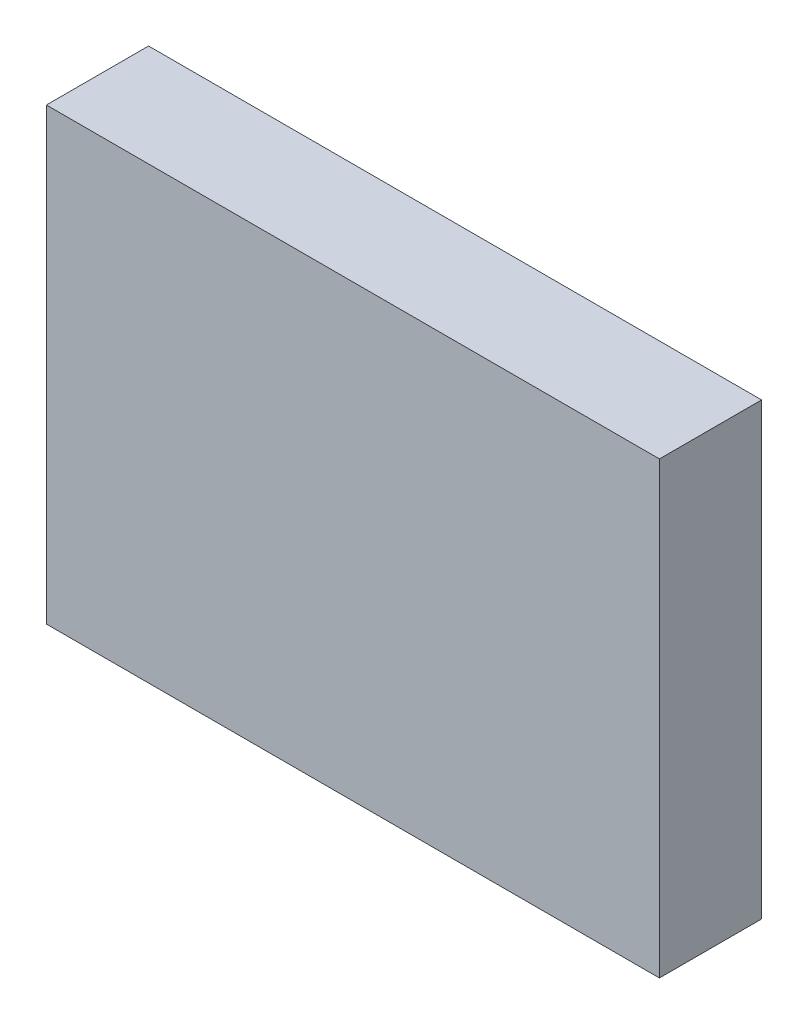
ISO-10303-21;
HEADER;
FILE_DESCRIPTION(('STEP AP214'),'2;1');
FILE_NAME('part.step','',(''),(''),'','','');
FILE_SCHEMA(('AUTOMOTIVE_DESIGN { 1 0 10303 214 1 1 1 1 }'));
ENDSEC;
DATA;
#1=APPLICATION_CONTEXT('core data for automotive mechanical design processes');
#2=APPLICATION_PROTOCOL_DEFINITION('international standard','automotive_design',2000,#1);
#3=PRODUCT_CONTEXT('',#1,'mechanical');
#4=PRODUCT('Part','Part','',(#3));
#5=PRODUCT_RELATED_PRODUCT_CATEGORY('part','',(#4));
#6=PRODUCT_DEFINITION_FORMATION('','',#4);
#7=PRODUCT_DEFINITION_CONTEXT('part definition',#1,'design');
#8=PRODUCT_DEFINITION('design','',#6,#7);
#9=PRODUCT_DEFINITION_SHAPE('','',#8);
#10=(LENGTH_UNIT() NAMED_UNIT(*) SI_UNIT(.MILLI.,.METRE.));
#11=(NAMED_UNIT(*) PLANE_ANGLE_UNIT() SI_UNIT($,.RADIAN.));
#12=(NAMED_UNIT(*) SI_UNIT($,.STERADIAN.) SOLID_ANGLE_UNIT());
#13=UNCERTAINTY_MEASURE_WITH_UNIT(LENGTH_MEASURE(1.E-05),#10,'distance_accuracy_value','');
#14=(GEOMETRIC_REPRESENTATION_CONTEXT(3) GLOBAL_UNCERTAINTY_ASSIGNED_CONTEXT((#13)) GLOBAL_UNIT_ASSIGNED_CONTEXT((#10,
#11,#12)) REPRESENTATION_CONTEXT('',''));
#15=CARTESIAN_POINT('',(0.,0.,0.));
#16=DIRECTION('',(0.,0.,1.));
#17=DIRECTION('',(1.,0.,0.));
#18=AXIS2_PLACEMENT_3D('',#15,#16,#17);
#19=CARTESIAN_POINT('',(7.5,5.5,2.5));
#20=DIRECTION('',(-1.,0.,0.));
#21=DIRECTION('',(0.,-1.,0.));
#22=AXIS2_PLACEMENT_3D('',#19,#20,#21);
#23=PLANE('',#22);
#24=DIRECTION('',(0.,1.,0.));
#25=VECTOR('',#24,1.);
#26=CARTESIAN_POINT('',(7.5,5.5,0.));
#27=LINE('',#26,#25);
#28=CARTESIAN_POINT('',(7.5,-5.5,0.));
#29=VERTEX_POINT('',#28);
#30=CARTESIAN_POINT('',(7.5,5.5,0.));
#31=VERTEX_POINT('',#30);
#32=EDGE_CURVE('E97',#29,#31,#27,.T.);
#33=ORIENTED_EDGE('',*,*,#32,.T.);
#34=DIRECTION('',(0.,0.,-1.));
#35=VECTOR('',#34,1.);
#36=CARTESIAN_POINT('',(7.5,5.5,2.5));
#37=LINE('',#36,#35);
#38=CARTESIAN_POINT('',(7.5,5.5,2.5));
#39=VERTEX_POINT('',#38);
#40=EDGE_CURVE('E11',#39,#31,#37,.T.);
#41=ORIENTED_EDGE('',*,*,#40,.F.);
#42=DIRECTION('',(0.,1.,0.));
#43=VECTOR('',#42,1.);
#44=CARTESIAN_POINT('',(7.5,5.5,2.5));
#45=LINE('',#44,#43);
#46=CARTESIAN_POINT('',(7.5,-5.5,2.5));
#47=VERTEX_POINT('',#46);
#48=EDGE_CURVE('E85',#47,#39,#45,.T.);
#49=ORIENTED_EDGE('',*,*,#48,.F.);
#50=DIRECTION('',(0.,0.,-1.));
#51=VECTOR('',#50,1.);
#52=CARTESIAN_POINT('',(7.5,-5.5,2.5));
#53=LINE('',#52,#51);
#54=EDGE_CURVE('E93',#47,#29,#53,.T.);
#55=ORIENTED_EDGE('',*,*,#54,.T.);
#56=EDGE_LOOP('',(#33,#41,#49,#55));
#57=FACE_BOUND('',#56,.T.);
#58=ADVANCED_FACE('F34',(#57),#23,.F.);
#59=CARTESIAN_POINT('',(-7.5,5.5,2.5));
#60=DIRECTION('',(0.,-1.,0.));
#61=DIRECTION('',(0.,0.,-1.));
#62=AXIS2_PLACEMENT_3D('',#59,#60,#61);
#63=PLANE('',#62);
#64=DIRECTION('',(-1.,0.,0.));
#65=VECTOR('',#64,1.);
#66=CARTESIAN_POINT('',(-7.5,5.5,0.));
#67=LINE('',#66,#65);
#68=CARTESIAN_POINT('',(-7.5,5.5,0.));
#69=VERTEX_POINT('',#68);
#70=EDGE_CURVE('E89',#31,#69,#67,.T.);
#71=ORIENTED_EDGE('',*,*,#70,.T.);
#72=DIRECTION('',(0.,0.,-1.));
#73=VECTOR('',#72,1.);
#74=CARTESIAN_POINT('',(-7.5,5.5,2.5));
#75=LINE('',#74,#73);
#76=CARTESIAN_POINT('',(-7.5,5.5,2.5));
#77=VERTEX_POINT('',#76);
#78=EDGE_CURVE('E42',#77,#69,#75,.T.);
#79=ORIENTED_EDGE('',*,*,#78,.F.);
#80=DIRECTION('',(-1.,0.,0.));
#81=VECTOR('',#80,1.);
#82=CARTESIAN_POINT('',(-7.5,5.5,2.5));
#83=LINE('',#82,#81);
#84=EDGE_CURVE('E80',#39,#77,#83,.T.);
#85=ORIENTED_EDGE('',*,*,#84,.F.);
#86=ORIENTED_EDGE('',*,*,#40,.T.);
#87=EDGE_LOOP('',(#71,#79,#85,#86));
#88=FACE_BOUND('',#87,.T.);
#89=ADVANCED_FACE('F88',(#88),#63,.F.);
#90=CARTESIAN_POINT('',(-7.5,5.5,2.5));
#91=DIRECTION('',(1.,0.,0.));
#92=DIRECTION('',(0.,1.,0.));
#93=AXIS2_PLACEMENT_3D('',#90,#91,#92);
#94=PLANE('',#93);
#95=DIRECTION('',(0.,-1.,0.));
#96=VECTOR('',#95,1.);
#97=CARTESIAN_POINT('',(-7.5,5.5,0.));
#98=LINE('',#97,#96);
#99=CARTESIAN_POINT('',(-7.5,-5.5,0.));
#100=VERTEX_POINT('',#99);
#101=EDGE_CURVE('E67',#69,#100,#98,.T.);
#102=ORIENTED_EDGE('',*,*,#101,.T.);
#103=DIRECTION('',(0.,0.,-1.));
#104=VECTOR('',#103,1.);
#105=CARTESIAN_POINT('',(-7.5,-5.5,2.5));
#106=LINE('',#105,#104);
#107=CARTESIAN_POINT('',(-7.5,-5.5,2.5));
#108=VERTEX_POINT('',#107);
#109=EDGE_CURVE('E90',#108,#100,#106,.T.);
#110=ORIENTED_EDGE('',*,*,#109,.F.);
#111=DIRECTION('',(0.,-1.,0.));
#112=VECTOR('',#111,1.);
#113=CARTESIAN_POINT('',(-7.5,5.5,2.5));
#114=LINE('',#113,#112);
#115=EDGE_CURVE('E83',#77,#108,#114,.T.);
#116=ORIENTED_EDGE('',*,*,#115,.F.);
#117=ORIENTED_EDGE('',*,*,#78,.T.);
#118=EDGE_LOOP('',(#102,#110,#116,#117));
#119=FACE_BOUND('',#118,.T.);
#120=ADVANCED_FACE('F91',(#119),#94,.F.);
#121=CARTESIAN_POINT('',(-7.5,-5.5,2.5));
#122=DIRECTION('',(0.,1.,0.));
#123=DIRECTION('',(0.,0.,1.));
#124=AXIS2_PLACEMENT_3D('',#121,#122,#123);
#125=PLANE('',#124);
#126=DIRECTION('',(1.,0.,0.));
#127=VECTOR('',#126,1.);
#128=CARTESIAN_POINT('',(-7.5,-5.5,0.));
#129=LINE('',#128,#127);
#130=EDGE_CURVE('E73',#100,#29,#129,.T.);
#131=ORIENTED_EDGE('',*,*,#130,.T.);
#132=ORIENTED_EDGE('',*,*,#54,.F.);
#133=DIRECTION('',(1.,0.,0.));
#134=VECTOR('',#133,1.);
#135=CARTESIAN_POINT('',(-7.5,-5.5,2.5));
#136=LINE('',#135,#134);
#137=EDGE_CURVE('E50',#108,#47,#136,.T.);
#138=ORIENTED_EDGE('',*,*,#137,.F.);
#139=ORIENTED_EDGE('',*,*,#109,.T.);
#140=EDGE_LOOP('',(#131,#132,#138,#139));
#141=FACE_BOUND('',#140,.T.);
#142=ADVANCED_FACE('F104',(#141),#125,.F.);
#143=CARTESIAN_POINT('',(0.,0.,2.5));
#144=DIRECTION('',(0.,0.,1.));
#145=DIRECTION('',(1.,0.,0.));
#146=AXIS2_PLACEMENT_3D('',#143,#144,#145);
#147=PLANE('',#146);
#148=ORIENTED_EDGE('',*,*,#48,.T.);
#149=ORIENTED_EDGE('',*,*,#84,.T.);
#150=ORIENTED_EDGE('',*,*,#115,.T.);
#151=ORIENTED_EDGE('',*,*,#137,.T.);
#152=EDGE_LOOP('',(#148,#149,#150,#151));
#153=FACE_BOUND('',#152,.T.);
#154=ADVANCED_FACE('F81',(#153),#147,.T.);
#155=CARTESIAN_POINT('',(0.,0.,0.));
#156=DIRECTION('',(0.,0.,1.));
#157=DIRECTION('',(1.,0.,0.));
#158=AXIS2_PLACEMENT_3D('',#155,#156,#157);
#159=PLANE('',#158);
#160=ORIENTED_EDGE('',*,*,#32,.F.);
#161=ORIENTED_EDGE('',*,*,#130,.F.);
#162=ORIENTED_EDGE('',*,*,#101,.F.);
#163=ORIENTED_EDGE('',*,*,#70,.F.);
#164=EDGE_LOOP('',(#160,#161,#162,#163));
#165=FACE_BOUND('',#164,.T.);
#166=ADVANCED_FACE('F107',(#165),#159,.F.);
#167=CLOSED_SHELL('',(#58,#89,#120,#142,#154,#166));
#168=MANIFOLD_SOLID_BREP('B2',#167);
#169=ADVANCED_BREP_SHAPE_REPRESENTATION('',(#18,#168),#14);
#170=SHAPE_DEFINITION_REPRESENTATION(#9,#169);
ENDSEC;
END-ISO-10303-21;
